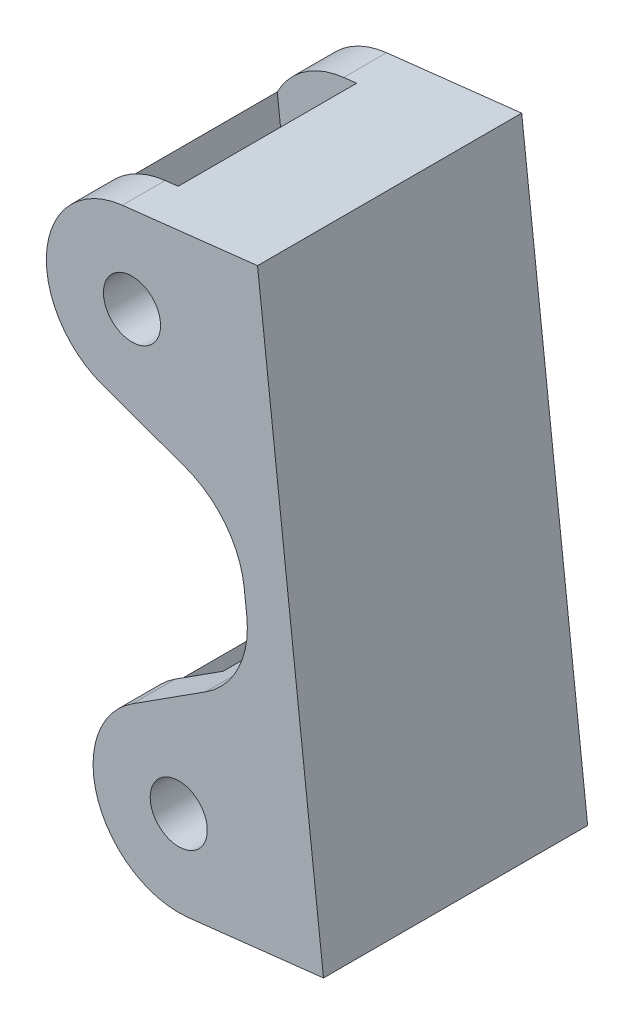
ISO-10303-21;
HEADER;
FILE_DESCRIPTION(('STEP AP214'),'2;1');
FILE_NAME('part.step','',(''),(''),'','','');
FILE_SCHEMA(('AUTOMOTIVE_DESIGN { 1 0 10303 214 1 1 1 1 }'));
ENDSEC;
DATA;
#1=APPLICATION_CONTEXT('core data for automotive mechanical design processes');
#2=APPLICATION_PROTOCOL_DEFINITION('international standard','automotive_design',2000,#1);
#3=PRODUCT_CONTEXT('',#1,'mechanical');
#4=PRODUCT('Part','Part','',(#3));
#5=PRODUCT_RELATED_PRODUCT_CATEGORY('part','',(#4));
#6=PRODUCT_DEFINITION_FORMATION('','',#4);
#7=PRODUCT_DEFINITION_CONTEXT('part definition',#1,'design');
#8=PRODUCT_DEFINITION('design','',#6,#7);
#9=PRODUCT_DEFINITION_SHAPE('','',#8);
#10=(LENGTH_UNIT() NAMED_UNIT(*) SI_UNIT(.MILLI.,.METRE.));
#11=(NAMED_UNIT(*) PLANE_ANGLE_UNIT() SI_UNIT($,.RADIAN.));
#12=(NAMED_UNIT(*) SI_UNIT($,.STERADIAN.) SOLID_ANGLE_UNIT());
#13=UNCERTAINTY_MEASURE_WITH_UNIT(LENGTH_MEASURE(1.E-05),#10,'distance_accuracy_value','');
#14=(GEOMETRIC_REPRESENTATION_CONTEXT(3) GLOBAL_UNCERTAINTY_ASSIGNED_CONTEXT((#13)) GLOBAL_UNIT_ASSIGNED_CONTEXT((#10,
#11,#12)) REPRESENTATION_CONTEXT('',''));
#15=CARTESIAN_POINT('',(0.,0.,0.));
#16=DIRECTION('',(0.,0.,1.));
#17=DIRECTION('',(1.,0.,0.));
#18=AXIS2_PLACEMENT_3D('',#15,#16,#17);
#19=CARTESIAN_POINT('',(100.855743208595,-311.690272512316,-18.5000000000001));
#20=DIRECTION('',(0.338368031046587,0.941013855140112,0.));
#21=DIRECTION('',(-0.941013855140112,0.338368031046587,0.));
#22=AXIS2_PLACEMENT_3D('',#19,#20,#21);
#23=PLANE('',#22);
#24=DIRECTION('',(-0.941013855140112,0.338368031046587,0.));
#25=VECTOR('',#24,1.);
#26=CARTESIAN_POINT('',(100.855743208595,-311.690272512316,12.4999999999999));
#27=LINE('',#26,#25);
#28=CARTESIAN_POINT('',(108.329287671099,-314.377595882639,12.4999999999999));
#29=VERTEX_POINT('',#28);
#30=CARTESIAN_POINT('',(100.855743208595,-311.690272512316,12.4999999999999));
#31=VERTEX_POINT('',#30);
#32=EDGE_CURVE('E250',#29,#31,#27,.T.);
#33=ORIENTED_EDGE('',*,*,#32,.F.);
#34=DIRECTION('',(0.,0.,-1.));
#35=VECTOR('',#34,1.);
#36=CARTESIAN_POINT('',(108.329287671099,-314.377595882639,-18.5000000000001));
#37=LINE('',#36,#35);
#38=CARTESIAN_POINT('',(108.329287671099,-314.377595882639,-12.5000000000001));
#39=VERTEX_POINT('',#38);
#40=EDGE_CURVE('E266',#29,#39,#37,.T.);
#41=ORIENTED_EDGE('',*,*,#40,.T.);
#42=DIRECTION('',(-0.941013855140112,0.338368031046587,0.));
#43=VECTOR('',#42,1.);
#44=CARTESIAN_POINT('',(100.855743208595,-311.690272512316,-12.5000000000001));
#45=LINE('',#44,#43);
#46=CARTESIAN_POINT('',(100.855743208595,-311.690272512316,-12.5000000000001));
#47=VERTEX_POINT('',#46);
#48=EDGE_CURVE('E390',#39,#47,#45,.T.);
#49=ORIENTED_EDGE('',*,*,#48,.T.);
#50=DIRECTION('',(0.,0.,1.));
#51=VECTOR('',#50,1.);
#52=CARTESIAN_POINT('',(100.855743208595,-311.690272512316,-18.5000000000001));
#53=LINE('',#52,#51);
#54=CARTESIAN_POINT('',(100.855743208595,-311.690272512316,-18.5000000000001));
#55=VERTEX_POINT('',#54);
#56=EDGE_CURVE('E358',#55,#47,#53,.T.);
#57=ORIENTED_EDGE('',*,*,#56,.F.);
#58=DIRECTION('',(-0.941013855140112,0.338368031046587,0.));
#59=VECTOR('',#58,1.);
#60=CARTESIAN_POINT('',(100.855743208595,-311.690272512316,-18.5000000000001));
#61=LINE('',#60,#59);
#62=CARTESIAN_POINT('',(112.302897911786,-315.806419343573,-18.5000000000001));
#63=VERTEX_POINT('',#62);
#64=EDGE_CURVE('E291',#63,#55,#61,.T.);
#65=ORIENTED_EDGE('',*,*,#64,.F.);
#66=DIRECTION('',(0.,0.,1.));
#67=VECTOR('',#66,1.);
#68=CARTESIAN_POINT('',(112.302897911786,-315.806419343573,-18.5000000000001));
#69=LINE('',#68,#67);
#70=CARTESIAN_POINT('',(112.302897911786,-315.806419343573,18.4999999999999));
#71=VERTEX_POINT('',#70);
#72=EDGE_CURVE('E361',#63,#71,#69,.T.);
#73=ORIENTED_EDGE('',*,*,#72,.T.);
#74=DIRECTION('',(-0.941013855140112,0.338368031046587,0.));
#75=VECTOR('',#74,1.);
#76=CARTESIAN_POINT('',(100.855743208595,-311.690272512316,18.4999999999999));
#77=LINE('',#76,#75);
#78=CARTESIAN_POINT('',(100.855743208595,-311.690272512316,18.4999999999999));
#79=VERTEX_POINT('',#78);
#80=EDGE_CURVE('E313',#71,#79,#77,.T.);
#81=ORIENTED_EDGE('',*,*,#80,.T.);
#82=EDGE_CURVE('E357',#31,#79,#53,.T.);
#83=ORIENTED_EDGE('',*,*,#82,.F.);
#84=EDGE_LOOP('',(#33,#41,#49,#57,#65,#73,#81,#83));
#85=FACE_BOUND('',#84,.T.);
#86=ADVANCED_FACE('F37',(#85),#23,.F.);
#87=CARTESIAN_POINT('',(104.916159581154,-300.398106250634,-18.5000000000001));
#88=DIRECTION('',(0.,0.,1.));
#89=DIRECTION('',(1.,0.,0.));
#90=AXIS2_PLACEMENT_3D('',#87,#88,#89);
#91=CYLINDRICAL_SURFACE('',#90,12.);
#92=CARTESIAN_POINT('',(104.916159581154,-300.398106250634,12.4999999999999));
#93=DIRECTION('',(0.,0.,-1.));
#94=DIRECTION('',(-1.,0.,0.));
#95=AXIS2_PLACEMENT_3D('',#92,#93,#94);
#96=CIRCLE('',#95,12.);
#97=CARTESIAN_POINT('',(94.2617769576401,-294.876862648712,12.4999999999999));
#98=VERTEX_POINT('',#97);
#99=CARTESIAN_POINT('',(103.569218525989,-288.473939621728,12.4999999999999));
#100=VERTEX_POINT('',#99);
#101=EDGE_CURVE('E247',#98,#100,#96,.T.);
#102=ORIENTED_EDGE('',*,*,#101,.F.);
#103=DIRECTION('',(0.,0.,1.));
#104=VECTOR('',#103,1.);
#105=CARTESIAN_POINT('',(94.2617769576401,-294.876862648712,-18.5000000000001));
#106=LINE('',#105,#104);
#107=CARTESIAN_POINT('',(94.2617769576401,-294.876862648712,-12.5000000000001));
#108=VERTEX_POINT('',#107);
#109=EDGE_CURVE('E269',#98,#108,#106,.F.);
#110=ORIENTED_EDGE('',*,*,#109,.T.);
#111=CARTESIAN_POINT('',(104.916159581154,-300.398106250634,-12.5000000000001));
#112=DIRECTION('',(0.,0.,-1.));
#113=DIRECTION('',(-1.,0.,0.));
#114=AXIS2_PLACEMENT_3D('',#111,#112,#113);
#115=CIRCLE('',#114,12.);
#116=CARTESIAN_POINT('',(103.569218525989,-288.473939621728,-12.5000000000001));
#117=VERTEX_POINT('',#116);
#118=EDGE_CURVE('E386',#108,#117,#115,.T.);
#119=ORIENTED_EDGE('',*,*,#118,.T.);
#120=DIRECTION('',(0.,0.,1.));
#121=VECTOR('',#120,1.);
#122=CARTESIAN_POINT('',(103.569218525989,-288.473939621728,-18.5000000000001));
#123=LINE('',#122,#121);
#124=CARTESIAN_POINT('',(103.569218525989,-288.473939621728,-18.5000000000001));
#125=VERTEX_POINT('',#124);
#126=EDGE_CURVE('E354',#125,#117,#123,.T.);
#127=ORIENTED_EDGE('',*,*,#126,.F.);
#128=CARTESIAN_POINT('',(104.916159581154,-300.398106250634,-18.5000000000001));
#129=DIRECTION('',(0.,0.,-1.));
#130=DIRECTION('',(-1.,0.,0.));
#131=AXIS2_PLACEMENT_3D('',#128,#129,#130);
#132=CIRCLE('',#131,12.);
#133=EDGE_CURVE('E294',#55,#125,#132,.T.);
#134=ORIENTED_EDGE('',*,*,#133,.F.);
#135=ORIENTED_EDGE('',*,*,#56,.T.);
#136=CARTESIAN_POINT('',(95.7618774470101,-308.156915347944,-12.5000000000001));
#137=VERTEX_POINT('',#136);
#138=EDGE_CURVE('E389',#47,#137,#115,.T.);
#139=ORIENTED_EDGE('',*,*,#138,.T.);
#140=DIRECTION('',(0.,0.,1.));
#141=VECTOR('',#140,1.);
#142=CARTESIAN_POINT('',(95.7618774470101,-308.156915347944,-18.5000000000001));
#143=LINE('',#142,#141);
#144=CARTESIAN_POINT('',(95.7618774470101,-308.156915347944,12.4999999999999));
#145=VERTEX_POINT('',#144);
#146=EDGE_CURVE('E272',#137,#145,#143,.T.);
#147=ORIENTED_EDGE('',*,*,#146,.T.);
#148=EDGE_CURVE('E249',#31,#145,#96,.T.);
#149=ORIENTED_EDGE('',*,*,#148,.F.);
#150=ORIENTED_EDGE('',*,*,#82,.T.);
#151=CARTESIAN_POINT('',(104.916159581154,-300.398106250634,18.4999999999999));
#152=DIRECTION('',(0.,0.,-1.));
#153=DIRECTION('',(-1.,0.,0.));
#154=AXIS2_PLACEMENT_3D('',#151,#152,#153);
#155=CIRCLE('',#154,12.);
#156=CARTESIAN_POINT('',(103.569218525989,-288.473939621728,18.4999999999999));
#157=VERTEX_POINT('',#156);
#158=EDGE_CURVE('E316',#79,#157,#155,.T.);
#159=ORIENTED_EDGE('',*,*,#158,.T.);
#160=EDGE_CURVE('E353',#100,#157,#123,.T.);
#161=ORIENTED_EDGE('',*,*,#160,.F.);
#162=EDGE_LOOP('',(#102,#110,#119,#127,#134,#135,#139,#147,#149,#150,#159,#161));
#163=FACE_BOUND('',#162,.T.);
#164=ADVANCED_FACE('F483',(#163),#91,.T.);
#165=CARTESIAN_POINT('',(122.497845378006,-286.335782262951,-18.5000000000001));
#166=DIRECTION('',(0.112245087930424,-0.993680552408817,0.));
#167=DIRECTION('',(0.993680552408817,0.112245087930424,0.));
#168=AXIS2_PLACEMENT_3D('',#165,#166,#167);
#169=PLANE('',#168);
#170=DIRECTION('',(0.993680552408817,0.112245087930424,0.));
#171=VECTOR('',#170,1.);
#172=CARTESIAN_POINT('',(122.497845378006,-286.335782262951,12.4999999999999));
#173=LINE('',#172,#171);
#174=CARTESIAN_POINT('',(105.380131738241,-288.269380810297,12.4999999999999));
#175=VERTEX_POINT('',#174);
#176=EDGE_CURVE('E245',#100,#175,#173,.T.);
#177=ORIENTED_EDGE('',*,*,#176,.F.);
#178=ORIENTED_EDGE('',*,*,#160,.T.);
#179=DIRECTION('',(0.993680552408817,0.112245087930424,0.));
#180=VECTOR('',#179,1.);
#181=CARTESIAN_POINT('',(122.497845378006,-286.335782262951,18.4999999999999));
#182=LINE('',#181,#180);
#183=CARTESIAN_POINT('',(122.497845378006,-286.335782262951,18.4999999999999));
#184=VERTEX_POINT('',#183);
#185=EDGE_CURVE('E319',#157,#184,#182,.T.);
#186=ORIENTED_EDGE('',*,*,#185,.T.);
#187=DIRECTION('',(0.,0.,1.));
#188=VECTOR('',#187,1.);
#189=CARTESIAN_POINT('',(122.497845378006,-286.335782262951,-18.5000000000001));
#190=LINE('',#189,#188);
#191=CARTESIAN_POINT('',(122.497845378006,-286.335782262951,-18.5000000000001));
#192=VERTEX_POINT('',#191);
#193=EDGE_CURVE('E350',#192,#184,#190,.T.);
#194=ORIENTED_EDGE('',*,*,#193,.F.);
#195=DIRECTION('',(0.993680552408817,0.112245087930424,0.));
#196=VECTOR('',#195,1.);
#197=CARTESIAN_POINT('',(122.497845378006,-286.335782262951,-18.5000000000001));
#198=LINE('',#197,#196);
#199=EDGE_CURVE('E296',#125,#192,#198,.T.);
#200=ORIENTED_EDGE('',*,*,#199,.F.);
#201=ORIENTED_EDGE('',*,*,#126,.T.);
#202=DIRECTION('',(0.993680552408817,0.112245087930424,0.));
#203=VECTOR('',#202,1.);
#204=CARTESIAN_POINT('',(122.497845378006,-286.335782262951,-12.5000000000001));
#205=LINE('',#204,#203);
#206=CARTESIAN_POINT('',(105.380131738241,-288.269380810297,-12.5000000000001));
#207=VERTEX_POINT('',#206);
#208=EDGE_CURVE('E379',#117,#207,#205,.T.);
#209=ORIENTED_EDGE('',*,*,#208,.T.);
#210=DIRECTION('',(0.,0.,1.));
#211=VECTOR('',#210,1.);
#212=CARTESIAN_POINT('',(105.380131738241,-288.269380810297,-18.5000000000001));
#213=LINE('',#212,#211);
#214=EDGE_CURVE('E263',#207,#175,#213,.T.);
#215=ORIENTED_EDGE('',*,*,#214,.T.);
#216=EDGE_LOOP('',(#177,#178,#186,#194,#200,#201,#209,#215));
#217=FACE_BOUND('',#216,.T.);
#218=ADVANCED_FACE('F486',(#217),#169,.F.);
#219=CARTESIAN_POINT('',(112.807269339854,-370.26518374454,-18.5000000000001));
#220=DIRECTION('',(-0.112245087930424,0.993680552408817,0.));
#221=DIRECTION('',(-0.993680552408817,-0.112245087930424,0.));
#222=AXIS2_PLACEMENT_3D('',#219,#220,#221);
#223=PLANE('',#222);
#224=DIRECTION('',(-0.993680552408817,-0.112245087930424,0.));
#225=VECTOR('',#224,1.);
#226=CARTESIAN_POINT('',(112.807269339854,-370.26518374454,12.4999999999999));
#227=LINE('',#226,#225);
#228=CARTESIAN_POINT('',(114.619170223477,-370.060513366811,12.4999999999999));
#229=VERTEX_POINT('',#228);
#230=CARTESIAN_POINT('',(112.807269339854,-370.26518374454,12.4999999999999));
#231=VERTEX_POINT('',#230);
#232=EDGE_CURVE('E239',#229,#231,#227,.T.);
#233=ORIENTED_EDGE('',*,*,#232,.F.);
#234=DIRECTION('',(0.,0.,-1.));
#235=VECTOR('',#234,1.);
#236=CARTESIAN_POINT('',(114.619170223477,-370.060513366811,-18.5000000000001));
#237=LINE('',#236,#235);
#238=CARTESIAN_POINT('',(114.619170223477,-370.060513366811,-12.5000000000001));
#239=VERTEX_POINT('',#238);
#240=EDGE_CURVE('E260',#229,#239,#237,.T.);
#241=ORIENTED_EDGE('',*,*,#240,.T.);
#242=DIRECTION('',(-0.993680552408817,-0.112245087930424,0.));
#243=VECTOR('',#242,1.);
#244=CARTESIAN_POINT('',(112.807269339854,-370.26518374454,-12.5000000000001));
#245=LINE('',#244,#243);
#246=CARTESIAN_POINT('',(112.807269339854,-370.26518374454,-12.5000000000001));
#247=VERTEX_POINT('',#246);
#248=EDGE_CURVE('E378',#239,#247,#245,.T.);
#249=ORIENTED_EDGE('',*,*,#248,.T.);
#250=DIRECTION('',(0.,0.,1.));
#251=VECTOR('',#250,1.);
#252=CARTESIAN_POINT('',(112.807269339854,-370.26518374454,-18.5000000000001));
#253=LINE('',#252,#251);
#254=CARTESIAN_POINT('',(112.807269339854,-370.26518374454,-18.5000000000001));
#255=VERTEX_POINT('',#254);
#256=EDGE_CURVE('E344',#255,#247,#253,.T.);
#257=ORIENTED_EDGE('',*,*,#256,.F.);
#258=DIRECTION('',(-0.993680552408817,-0.112245087930424,0.));
#259=VECTOR('',#258,1.);
#260=CARTESIAN_POINT('',(112.807269339854,-370.26518374454,-18.5000000000001));
#261=LINE('',#260,#259);
#262=CARTESIAN_POINT('',(131.736883863242,-368.126914819466,-18.5000000000001));
#263=VERTEX_POINT('',#262);
#264=EDGE_CURVE('E300',#263,#255,#261,.T.);
#265=ORIENTED_EDGE('',*,*,#264,.F.);
#266=DIRECTION('',(0.,0.,1.));
#267=VECTOR('',#266,1.);
#268=CARTESIAN_POINT('',(131.736883863242,-368.126914819466,-18.5000000000001));
#269=LINE('',#268,#267);
#270=CARTESIAN_POINT('',(131.736883863242,-368.126914819466,18.4999999999999));
#271=VERTEX_POINT('',#270);
#272=EDGE_CURVE('E347',#263,#271,#269,.T.);
#273=ORIENTED_EDGE('',*,*,#272,.T.);
#274=DIRECTION('',(-0.993680552408817,-0.112245087930424,0.));
#275=VECTOR('',#274,1.);
#276=CARTESIAN_POINT('',(112.807269339854,-370.26518374454,18.4999999999999));
#277=LINE('',#276,#275);
#278=CARTESIAN_POINT('',(112.807269339854,-370.26518374454,18.4999999999999));
#279=VERTEX_POINT('',#278);
#280=EDGE_CURVE('E323',#271,#279,#277,.T.);
#281=ORIENTED_EDGE('',*,*,#280,.T.);
#282=EDGE_CURVE('E343',#231,#279,#253,.T.);
#283=ORIENTED_EDGE('',*,*,#282,.F.);
#284=EDGE_LOOP('',(#233,#241,#249,#257,#265,#273,#281,#283));
#285=FACE_BOUND('',#284,.T.);
#286=ADVANCED_FACE('F435',(#285),#223,.F.);
#287=CARTESIAN_POINT('',(111.460328284689,-358.341017115634,-18.5000000000001));
#288=DIRECTION('',(0.,0.,1.));
#289=DIRECTION('',(1.,0.,0.));
#290=AXIS2_PLACEMENT_3D('',#287,#288,#289);
#291=CYLINDRICAL_SURFACE('',#290,12.);
#292=CARTESIAN_POINT('',(111.460328284689,-358.341017115634,12.4999999999999));
#293=DIRECTION('',(0.,0.,-1.));
#294=DIRECTION('',(-1.,0.,0.));
#295=AXIS2_PLACEMENT_3D('',#292,#293,#294);
#296=CIRCLE('',#295,12.);
#297=CARTESIAN_POINT('',(100.806766945848,-352.818188963359,12.4999999999999));
#298=VERTEX_POINT('',#297);
#299=CARTESIAN_POINT('',(104.984197969497,-348.238555230497,12.4999999999999));
#300=VERTEX_POINT('',#299);
#301=EDGE_CURVE('E231',#298,#300,#296,.T.);
#302=ORIENTED_EDGE('',*,*,#301,.F.);
#303=DIRECTION('',(0.,0.,1.));
#304=VECTOR('',#303,1.);
#305=CARTESIAN_POINT('',(100.806766945848,-352.818188963359,-18.5000000000001));
#306=LINE('',#305,#304);
#307=CARTESIAN_POINT('',(100.806766945848,-352.818188963359,-12.5000000000001));
#308=VERTEX_POINT('',#307);
#309=EDGE_CURVE('E11',#298,#308,#306,.F.);
#310=ORIENTED_EDGE('',*,*,#309,.T.);
#311=CARTESIAN_POINT('',(111.460328284689,-358.341017115634,-12.5000000000001));
#312=DIRECTION('',(0.,0.,-1.));
#313=DIRECTION('',(-1.,0.,0.));
#314=AXIS2_PLACEMENT_3D('',#311,#312,#313);
#315=CIRCLE('',#314,12.);
#316=CARTESIAN_POINT('',(104.984197969497,-348.238555230497,-12.5000000000001));
#317=VERTEX_POINT('',#316);
#318=EDGE_CURVE('E208',#308,#317,#315,.T.);
#319=ORIENTED_EDGE('',*,*,#318,.T.);
#320=DIRECTION('',(0.,0.,1.));
#321=VECTOR('',#320,1.);
#322=CARTESIAN_POINT('',(104.984197969497,-348.238555230497,-18.5000000000001));
#323=LINE('',#322,#321);
#324=CARTESIAN_POINT('',(104.984197969497,-348.238555230497,-18.5000000000001));
#325=VERTEX_POINT('',#324);
#326=EDGE_CURVE('E341',#325,#317,#323,.T.);
#327=ORIENTED_EDGE('',*,*,#326,.F.);
#328=CARTESIAN_POINT('',(111.460328284689,-358.341017115634,-18.5000000000001));
#329=DIRECTION('',(0.,0.,-1.));
#330=DIRECTION('',(-1.,0.,0.));
#331=AXIS2_PLACEMENT_3D('',#328,#329,#330);
#332=CIRCLE('',#331,12.);
#333=EDGE_CURVE('E302',#255,#325,#332,.T.);
#334=ORIENTED_EDGE('',*,*,#333,.F.);
#335=ORIENTED_EDGE('',*,*,#256,.T.);
#336=CARTESIAN_POINT('',(102.307200208612,-366.101187630703,-12.5000000000001));
#337=VERTEX_POINT('',#336);
#338=EDGE_CURVE('E218',#247,#337,#315,.T.);
#339=ORIENTED_EDGE('',*,*,#338,.T.);
#340=DIRECTION('',(0.,0.,1.));
#341=VECTOR('',#340,1.);
#342=CARTESIAN_POINT('',(102.307200208612,-366.101187630703,-18.5000000000001));
#343=LINE('',#342,#341);
#344=CARTESIAN_POINT('',(102.307200208612,-366.101187630703,12.4999999999999));
#345=VERTEX_POINT('',#344);
#346=EDGE_CURVE('E45',#337,#345,#343,.T.);
#347=ORIENTED_EDGE('',*,*,#346,.T.);
#348=EDGE_CURVE('E236',#231,#345,#296,.T.);
#349=ORIENTED_EDGE('',*,*,#348,.F.);
#350=ORIENTED_EDGE('',*,*,#282,.T.);
#351=CARTESIAN_POINT('',(111.460328284689,-358.341017115634,18.4999999999999));
#352=DIRECTION('',(0.,0.,-1.));
#353=DIRECTION('',(-1.,0.,0.));
#354=AXIS2_PLACEMENT_3D('',#351,#352,#353);
#355=CIRCLE('',#354,12.);
#356=CARTESIAN_POINT('',(104.984197969497,-348.238555230497,18.4999999999999));
#357=VERTEX_POINT('',#356);
#358=EDGE_CURVE('E326',#279,#357,#355,.T.);
#359=ORIENTED_EDGE('',*,*,#358,.T.);
#360=EDGE_CURVE('E233',#300,#357,#323,.T.);
#361=ORIENTED_EDGE('',*,*,#360,.F.);
#362=EDGE_LOOP('',(#302,#310,#319,#327,#334,#335,#339,#347,#349,#350,#359,#361));
#363=FACE_BOUND('',#362,.T.);
#364=ADVANCED_FACE('F229',(#363),#291,.T.);
#365=CARTESIAN_POINT('',(104.984197969497,-348.238555230497,-18.5000000000001));
#366=DIRECTION('',(0.539677526265937,-0.841871823761479,0.));
#367=DIRECTION('',(0.841871823761479,0.539677526265937,0.));
#368=AXIS2_PLACEMENT_3D('',#365,#366,#367);
#369=PLANE('',#368);
#370=DIRECTION('',(0.841871823761479,0.539677526265937,0.));
#371=VECTOR('',#370,1.);
#372=CARTESIAN_POINT('',(104.984197969497,-348.238555230497,12.4999999999999));
#373=LINE('',#372,#371);
#374=CARTESIAN_POINT('',(111.670051091077,-343.952624080657,12.4999999999999));
#375=VERTEX_POINT('',#374);
#376=EDGE_CURVE('E237',#300,#375,#373,.T.);
#377=ORIENTED_EDGE('',*,*,#376,.F.);
#378=ORIENTED_EDGE('',*,*,#360,.T.);
#379=DIRECTION('',(0.841871823761479,0.539677526265937,0.));
#380=VECTOR('',#379,1.);
#381=CARTESIAN_POINT('',(104.984197969497,-348.238555230497,18.4999999999999));
#382=LINE('',#381,#380);
#383=CARTESIAN_POINT('',(115.223866434292,-341.674469355555,18.4999999999999));
#384=VERTEX_POINT('',#383);
#385=EDGE_CURVE('E328',#357,#384,#382,.T.);
#386=ORIENTED_EDGE('',*,*,#385,.T.);
#387=DIRECTION('',(0.,0.,1.));
#388=VECTOR('',#387,1.);
#389=CARTESIAN_POINT('',(115.223866434292,-341.674469355555,-18.5000000000001));
#390=LINE('',#389,#388);
#391=CARTESIAN_POINT('',(115.223866434292,-341.674469355555,-18.5000000000001));
#392=VERTEX_POINT('',#391);
#393=EDGE_CURVE('E338',#392,#384,#390,.T.);
#394=ORIENTED_EDGE('',*,*,#393,.F.);
#395=DIRECTION('',(0.841871823761479,0.539677526265937,0.));
#396=VECTOR('',#395,1.);
#397=CARTESIAN_POINT('',(104.984197969497,-348.238555230497,-18.5000000000001));
#398=LINE('',#397,#396);
#399=EDGE_CURVE('E304',#325,#392,#398,.T.);
#400=ORIENTED_EDGE('',*,*,#399,.F.);
#401=ORIENTED_EDGE('',*,*,#326,.T.);
#402=DIRECTION('',(0.841871823761479,0.539677526265937,0.));
#403=VECTOR('',#402,1.);
#404=CARTESIAN_POINT('',(104.984197969497,-348.238555230497,-12.5000000000001));
#405=LINE('',#404,#403);
#406=CARTESIAN_POINT('',(111.670051091077,-343.952624080657,-12.5000000000001));
#407=VERTEX_POINT('',#406);
#408=EDGE_CURVE('E214',#317,#407,#405,.T.);
#409=ORIENTED_EDGE('',*,*,#408,.T.);
#410=DIRECTION('',(0.,0.,1.));
#411=VECTOR('',#410,1.);
#412=CARTESIAN_POINT('',(111.670051091077,-343.952624080657,-18.5000000000001));
#413=LINE('',#412,#411);
#414=EDGE_CURVE('E257',#407,#375,#413,.T.);
#415=ORIENTED_EDGE('',*,*,#414,.T.);
#416=EDGE_LOOP('',(#377,#378,#386,#394,#400,#401,#409,#415));
#417=FACE_BOUND('',#416,.T.);
#418=ADVANCED_FACE('F423',(#417),#369,.F.);
#419=CARTESIAN_POINT('',(104.916159581154,-300.398106250634,-18.5000000000001));
#420=DIRECTION('',(0.,0.,1.));
#421=DIRECTION('',(1.,0.,0.));
#422=AXIS2_PLACEMENT_3D('',#419,#420,#421);
#423=CYLINDRICAL_SURFACE('',#422,3.99999999999998);
#424=CARTESIAN_POINT('',(104.916159581154,-300.398106250634,-18.5000000000001));
#425=DIRECTION('',(0.,0.,-1.));
#426=DIRECTION('',(-1.,0.,0.));
#427=AXIS2_PLACEMENT_3D('',#424,#425,#426);
#428=CIRCLE('',#427,3.99999999999998);
#429=CARTESIAN_POINT('',(100.916159581154,-300.398106250634,-18.5000000000001));
#430=VERTEX_POINT('',#429);
#431=EDGE_CURVE('E282',#430,#430,#428,.T.);
#432=ORIENTED_EDGE('',*,*,#431,.T.);
#433=EDGE_LOOP('',(#432));
#434=FACE_BOUND('',#433,.T.);
#435=CARTESIAN_POINT('',(104.916159581154,-300.398106250634,18.4999999999999));
#436=DIRECTION('',(0.,0.,-1.));
#437=DIRECTION('',(-1.,0.,0.));
#438=AXIS2_PLACEMENT_3D('',#435,#436,#437);
#439=CIRCLE('',#438,3.99999999999998);
#440=CARTESIAN_POINT('',(100.916159581154,-300.398106250634,18.4999999999999));
#441=VERTEX_POINT('',#440);
#442=EDGE_CURVE('E279',#441,#441,#439,.T.);
#443=ORIENTED_EDGE('',*,*,#442,.F.);
#444=EDGE_LOOP('',(#443));
#445=FACE_BOUND('',#444,.T.);
#446=DIRECTION('',(0.,0.,1.));
#447=VECTOR('',#446,1.);
#448=CARTESIAN_POINT('',(107.126746471421,-303.731768741136,-18.5000000000001));
#449=LINE('',#448,#447);
#450=CARTESIAN_POINT('',(107.126746471421,-303.731768741136,12.4999999999999));
#451=VERTEX_POINT('',#450);
#452=CARTESIAN_POINT('',(107.126746471421,-303.731768741136,-12.5000000000001));
#453=VERTEX_POINT('',#452);
#454=EDGE_CURVE('E252',#451,#453,#449,.F.);
#455=ORIENTED_EDGE('',*,*,#454,.F.);
#456=CARTESIAN_POINT('',(104.916159581154,-300.398106250634,12.4999999999999));
#457=DIRECTION('',(0.,0.,-1.));
#458=DIRECTION('',(-1.,0.,0.));
#459=AXIS2_PLACEMENT_3D('',#456,#457,#458);
#460=CIRCLE('',#459,3.99999999999998);
#461=CARTESIAN_POINT('',(106.327399115392,-296.655326137269,12.4999999999999));
#462=VERTEX_POINT('',#461);
#463=EDGE_CURVE('E240',#451,#462,#460,.T.);
#464=ORIENTED_EDGE('',*,*,#463,.T.);
#465=DIRECTION('',(0.,0.,1.));
#466=VECTOR('',#465,1.);
#467=CARTESIAN_POINT('',(106.327399115392,-296.655326137269,-18.5000000000001));
#468=LINE('',#467,#466);
#469=CARTESIAN_POINT('',(106.327399115392,-296.655326137269,-12.5000000000001));
#470=VERTEX_POINT('',#469);
#471=EDGE_CURVE('E255',#470,#462,#468,.T.);
#472=ORIENTED_EDGE('',*,*,#471,.F.);
#473=CARTESIAN_POINT('',(104.916159581154,-300.398106250634,-12.5000000000001));
#474=DIRECTION('',(0.,0.,-1.));
#475=DIRECTION('',(-1.,0.,0.));
#476=AXIS2_PLACEMENT_3D('',#473,#474,#475);
#477=CIRCLE('',#476,3.99999999999998);
#478=EDGE_CURVE('E412',#453,#470,#477,.T.);
#479=ORIENTED_EDGE('',*,*,#478,.F.);
#480=EDGE_LOOP('',(#455,#464,#472,#479));
#481=FACE_BOUND('',#480,.T.);
#482=ADVANCED_FACE('F396',(#434,#445,#481),#423,.F.);
#483=CARTESIAN_POINT('',(111.460328284689,-358.341017115634,-18.5000000000001));
#484=DIRECTION('',(0.,0.,1.));
#485=DIRECTION('',(1.,0.,0.));
#486=AXIS2_PLACEMENT_3D('',#483,#484,#485);
#487=CYLINDRICAL_SURFACE('',#486,3.99999999999999);
#488=CARTESIAN_POINT('',(111.460328284689,-358.341017115634,-18.5000000000001));
#489=DIRECTION('',(0.,0.,-1.));
#490=DIRECTION('',(-1.,0.,0.));
#491=AXIS2_PLACEMENT_3D('',#488,#489,#490);
#492=CIRCLE('',#491,3.99999999999999);
#493=CARTESIAN_POINT('',(107.460328284689,-358.341017115634,-18.5000000000001));
#494=VERTEX_POINT('',#493);
#495=EDGE_CURVE('E276',#494,#494,#492,.T.);
#496=ORIENTED_EDGE('',*,*,#495,.T.);
#497=EDGE_LOOP('',(#496));
#498=FACE_BOUND('',#497,.T.);
#499=CARTESIAN_POINT('',(111.460328284689,-358.341017115634,18.4999999999999));
#500=DIRECTION('',(0.,0.,-1.));
#501=DIRECTION('',(-1.,0.,0.));
#502=AXIS2_PLACEMENT_3D('',#499,#500,#501);
#503=CIRCLE('',#502,3.99999999999999);
#504=CARTESIAN_POINT('',(107.460328284689,-358.341017115634,18.4999999999999));
#505=VERTEX_POINT('',#504);
#506=EDGE_CURVE('E275',#505,#505,#503,.T.);
#507=ORIENTED_EDGE('',*,*,#506,.F.);
#508=EDGE_LOOP('',(#507));
#509=FACE_BOUND('',#508,.T.);
#510=DIRECTION('',(0.,0.,1.));
#511=VECTOR('',#510,1.);
#512=CARTESIAN_POINT('',(113.671845725416,-361.674062361255,-18.5000000000001));
#513=LINE('',#512,#511);
#514=CARTESIAN_POINT('',(113.671845725416,-361.674062361255,12.4999999999999));
#515=VERTEX_POINT('',#514);
#516=CARTESIAN_POINT('',(113.671845725416,-361.674062361255,-12.5000000000001));
#517=VERTEX_POINT('',#516);
#518=EDGE_CURVE('E366',#515,#517,#513,.F.);
#519=ORIENTED_EDGE('',*,*,#518,.F.);
#520=CARTESIAN_POINT('',(111.460328284689,-358.341017115634,12.4999999999999));
#521=DIRECTION('',(0.,0.,-1.));
#522=DIRECTION('',(-1.,0.,0.));
#523=AXIS2_PLACEMENT_3D('',#520,#521,#522);
#524=CIRCLE('',#523,3.99999999999999);
#525=CARTESIAN_POINT('',(112.872612611207,-354.598631114555,12.4999999999999));
#526=VERTEX_POINT('',#525);
#527=EDGE_CURVE('E371',#515,#526,#524,.T.);
#528=ORIENTED_EDGE('',*,*,#527,.T.);
#529=DIRECTION('',(0.,0.,1.));
#530=VECTOR('',#529,1.);
#531=CARTESIAN_POINT('',(112.872612611207,-354.598631114555,-18.5000000000001));
#532=LINE('',#531,#530);
#533=CARTESIAN_POINT('',(112.872612611207,-354.598631114555,-12.5000000000001));
#534=VERTEX_POINT('',#533);
#535=EDGE_CURVE('E369',#534,#526,#532,.T.);
#536=ORIENTED_EDGE('',*,*,#535,.F.);
#537=CARTESIAN_POINT('',(111.460328284689,-358.341017115634,-12.5000000000001));
#538=DIRECTION('',(0.,0.,-1.));
#539=DIRECTION('',(-1.,0.,0.));
#540=AXIS2_PLACEMENT_3D('',#537,#538,#539);
#541=CIRCLE('',#540,3.99999999999999);
#542=EDGE_CURVE('E364',#517,#534,#541,.T.);
#543=ORIENTED_EDGE('',*,*,#542,.F.);
#544=EDGE_LOOP('',(#519,#528,#536,#543));
#545=FACE_BOUND('',#544,.T.);
#546=ADVANCED_FACE('F443',(#498,#509,#545),#487,.F.);
#547=CARTESIAN_POINT('',(108.005623917494,-327.757295303852,-18.5000000000001));
#548=DIRECTION('',(0.,0.,-1.));
#549=DIRECTION('',(-1.,0.,0.));
#550=AXIS2_PLACEMENT_3D('',#547,#548,#549);
#551=PLANE('',#550);
#552=ORIENTED_EDGE('',*,*,#431,.F.);
#553=EDGE_LOOP('',(#552));
#554=FACE_BOUND('',#553,.T.);
#555=CARTESIAN_POINT('',(108.005623917494,-327.757295303852,-18.5000000000001));
#556=DIRECTION('',(0.,0.,1.));
#557=DIRECTION('',(-1.,0.,0.));
#558=AXIS2_PLACEMENT_3D('',#555,#556,#557);
#559=CIRCLE('',#558,12.7);
#560=CARTESIAN_POINT('',(120.625366933086,-326.331782687136,-18.5000000000001));
#561=VERTEX_POINT('',#560);
#562=EDGE_CURVE('E288',#561,#63,#559,.T.);
#563=ORIENTED_EDGE('',*,*,#562,.T.);
#564=ORIENTED_EDGE('',*,*,#64,.T.);
#565=ORIENTED_EDGE('',*,*,#133,.T.);
#566=ORIENTED_EDGE('',*,*,#199,.T.);
#567=DIRECTION('',(0.112245087930422,-0.993680552408817,0.));
#568=VECTOR('',#567,1.);
#569=CARTESIAN_POINT('',(131.736883863242,-368.126914819466,-18.5000000000001));
#570=LINE('',#569,#568);
#571=EDGE_CURVE('E298',#192,#263,#570,.T.);
#572=ORIENTED_EDGE('',*,*,#571,.T.);
#573=ORIENTED_EDGE('',*,*,#264,.T.);
#574=ORIENTED_EDGE('',*,*,#333,.T.);
#575=ORIENTED_EDGE('',*,*,#399,.T.);
#576=CARTESIAN_POINT('',(108.369961850715,-330.982697193784,-18.5000000000001));
#577=DIRECTION('',(0.,0.,1.));
#578=DIRECTION('',(1.,0.,0.));
#579=AXIS2_PLACEMENT_3D('',#576,#577,#578);
#580=CIRCLE('',#579,12.7);
#581=CARTESIAN_POINT('',(120.989704866307,-329.557184577068,-18.5000000000001));
#582=VERTEX_POINT('',#581);
#583=EDGE_CURVE('E306',#392,#582,#580,.T.);
#584=ORIENTED_EDGE('',*,*,#583,.T.);
#585=DIRECTION('',(-0.112245087930422,0.993680552408817,0.));
#586=VECTOR('',#585,1.);
#587=CARTESIAN_POINT('',(120.625366933086,-326.331782687136,-18.5000000000001));
#588=LINE('',#587,#586);
#589=EDGE_CURVE('E308',#582,#561,#588,.T.);
#590=ORIENTED_EDGE('',*,*,#589,.T.);
#591=EDGE_LOOP('',(#563,#564,#565,#566,#572,#573,#574,#575,#584,#590));
#592=FACE_BOUND('',#591,.T.);
#593=ORIENTED_EDGE('',*,*,#495,.F.);
#594=EDGE_LOOP('',(#593));
#595=FACE_BOUND('',#594,.T.);
#596=ADVANCED_FACE('F428',(#554,#592,#595),#551,.T.);
#597=CARTESIAN_POINT('',(108.005623917494,-327.757295303852,18.4999999999999));
#598=DIRECTION('',(0.,0.,-1.));
#599=DIRECTION('',(-1.,0.,0.));
#600=AXIS2_PLACEMENT_3D('',#597,#598,#599);
#601=PLANE('',#600);
#602=CARTESIAN_POINT('',(108.005623917494,-327.757295303852,18.4999999999999));
#603=DIRECTION('',(0.,0.,1.));
#604=DIRECTION('',(-1.,0.,0.));
#605=AXIS2_PLACEMENT_3D('',#602,#603,#604);
#606=CIRCLE('',#605,12.7);
#607=CARTESIAN_POINT('',(120.625366933086,-326.331782687136,18.4999999999999));
#608=VERTEX_POINT('',#607);
#609=EDGE_CURVE('E285',#608,#71,#606,.T.);
#610=ORIENTED_EDGE('',*,*,#609,.F.);
#611=DIRECTION('',(-0.112245087930422,0.993680552408817,0.));
#612=VECTOR('',#611,1.);
#613=CARTESIAN_POINT('',(120.625366933086,-326.331782687136,18.4999999999999));
#614=LINE('',#613,#612);
#615=CARTESIAN_POINT('',(120.989704866307,-329.557184577068,18.4999999999999));
#616=VERTEX_POINT('',#615);
#617=EDGE_CURVE('E292',#616,#608,#614,.T.);
#618=ORIENTED_EDGE('',*,*,#617,.F.);
#619=CARTESIAN_POINT('',(108.369961850715,-330.982697193784,18.4999999999999));
#620=DIRECTION('',(0.,0.,1.));
#621=DIRECTION('',(1.,0.,0.));
#622=AXIS2_PLACEMENT_3D('',#619,#620,#621);
#623=CIRCLE('',#622,12.7);
#624=EDGE_CURVE('E330',#384,#616,#623,.T.);
#625=ORIENTED_EDGE('',*,*,#624,.F.);
#626=ORIENTED_EDGE('',*,*,#385,.F.);
#627=ORIENTED_EDGE('',*,*,#358,.F.);
#628=ORIENTED_EDGE('',*,*,#280,.F.);
#629=DIRECTION('',(0.112245087930422,-0.993680552408817,0.));
#630=VECTOR('',#629,1.);
#631=CARTESIAN_POINT('',(131.736883863242,-368.126914819466,18.4999999999999));
#632=LINE('',#631,#630);
#633=EDGE_CURVE('E321',#184,#271,#632,.T.);
#634=ORIENTED_EDGE('',*,*,#633,.F.);
#635=ORIENTED_EDGE('',*,*,#185,.F.);
#636=ORIENTED_EDGE('',*,*,#158,.F.);
#637=ORIENTED_EDGE('',*,*,#80,.F.);
#638=EDGE_LOOP('',(#610,#618,#625,#626,#627,#628,#634,#635,#636,#637));
#639=FACE_BOUND('',#638,.T.);
#640=ORIENTED_EDGE('',*,*,#442,.T.);
#641=EDGE_LOOP('',(#640));
#642=FACE_BOUND('',#641,.T.);
#643=ORIENTED_EDGE('',*,*,#506,.T.);
#644=EDGE_LOOP('',(#643));
#645=FACE_BOUND('',#644,.T.);
#646=ADVANCED_FACE('F460',(#639,#642,#645),#601,.F.);
#647=CARTESIAN_POINT('',(108.005623917494,-327.757295303852,-18.5000000000001));
#648=DIRECTION('',(0.,0.,1.));
#649=DIRECTION('',(1.,0.,0.));
#650=AXIS2_PLACEMENT_3D('',#647,#648,#649);
#651=CYLINDRICAL_SURFACE('',#650,12.7);
#652=ORIENTED_EDGE('',*,*,#609,.T.);
#653=ORIENTED_EDGE('',*,*,#72,.F.);
#654=ORIENTED_EDGE('',*,*,#562,.F.);
#655=DIRECTION('',(0.,0.,1.));
#656=VECTOR('',#655,1.);
#657=CARTESIAN_POINT('',(120.625366933086,-326.331782687136,-18.5000000000001));
#658=LINE('',#657,#656);
#659=EDGE_CURVE('E310',#561,#608,#658,.T.);
#660=ORIENTED_EDGE('',*,*,#659,.T.);
#661=EDGE_LOOP('',(#652,#653,#654,#660));
#662=FACE_BOUND('',#661,.T.);
#663=ADVANCED_FACE('F39',(#662),#651,.F.);
#664=CARTESIAN_POINT('',(131.736883863242,-368.126914819466,-18.5000000000001));
#665=DIRECTION('',(-0.993680552408817,-0.112245087930422,0.));
#666=DIRECTION('',(0.112245087930422,-0.993680552408817,0.));
#667=AXIS2_PLACEMENT_3D('',#664,#665,#666);
#668=PLANE('',#667);
#669=ORIENTED_EDGE('',*,*,#633,.T.);
#670=ORIENTED_EDGE('',*,*,#272,.F.);
#671=ORIENTED_EDGE('',*,*,#571,.F.);
#672=ORIENTED_EDGE('',*,*,#193,.T.);
#673=EDGE_LOOP('',(#669,#670,#671,#672));
#674=FACE_BOUND('',#673,.T.);
#675=ADVANCED_FACE('F490',(#674),#668,.F.);
#676=CARTESIAN_POINT('',(108.369961850715,-330.982697193784,-18.5000000000001));
#677=DIRECTION('',(0.,0.,1.));
#678=DIRECTION('',(1.,0.,0.));
#679=AXIS2_PLACEMENT_3D('',#676,#677,#678);
#680=CYLINDRICAL_SURFACE('',#679,12.7);
#681=ORIENTED_EDGE('',*,*,#624,.T.);
#682=DIRECTION('',(0.,0.,1.));
#683=VECTOR('',#682,1.);
#684=CARTESIAN_POINT('',(120.989704866307,-329.557184577068,-18.5000000000001));
#685=LINE('',#684,#683);
#686=EDGE_CURVE('E335',#582,#616,#685,.T.);
#687=ORIENTED_EDGE('',*,*,#686,.F.);
#688=ORIENTED_EDGE('',*,*,#583,.F.);
#689=ORIENTED_EDGE('',*,*,#393,.T.);
#690=EDGE_LOOP('',(#681,#687,#688,#689));
#691=FACE_BOUND('',#690,.T.);
#692=ADVANCED_FACE('F465',(#691),#680,.F.);
#693=CARTESIAN_POINT('',(120.625366933086,-326.331782687136,-18.5000000000001));
#694=DIRECTION('',(0.993680552408817,0.112245087930422,0.));
#695=DIRECTION('',(-0.112245087930422,0.993680552408817,0.));
#696=AXIS2_PLACEMENT_3D('',#693,#694,#695);
#697=PLANE('',#696);
#698=ORIENTED_EDGE('',*,*,#617,.T.);
#699=ORIENTED_EDGE('',*,*,#659,.F.);
#700=ORIENTED_EDGE('',*,*,#589,.F.);
#701=ORIENTED_EDGE('',*,*,#686,.T.);
#702=EDGE_LOOP('',(#698,#699,#700,#701));
#703=FACE_BOUND('',#702,.T.);
#704=ADVANCED_FACE('F472',(#703),#697,.F.);
#705=CARTESIAN_POINT('',(0.,0.,-12.5000000000001));
#706=DIRECTION('',(0.,0.,-1.));
#707=DIRECTION('',(-1.,0.,0.));
#708=AXIS2_PLACEMENT_3D('',#705,#706,#707);
#709=PLANE('',#708);
#710=DIRECTION('',(0.112245087930422,-0.993680552408817,0.));
#711=VECTOR('',#710,1.);
#712=CARTESIAN_POINT('',(115.46801169958,-377.575116298969,-12.5000000000001));
#713=LINE('',#712,#711);
#714=EDGE_CURVE('E226',#517,#239,#713,.T.);
#715=ORIENTED_EDGE('',*,*,#714,.F.);
#716=ORIENTED_EDGE('',*,*,#542,.T.);
#717=EDGE_CURVE('E421',#407,#534,#713,.T.);
#718=ORIENTED_EDGE('',*,*,#717,.F.);
#719=ORIENTED_EDGE('',*,*,#408,.F.);
#720=ORIENTED_EDGE('',*,*,#318,.F.);
#721=DIRECTION('',(-0.112245087930422,0.993680552408817,0.));
#722=VECTOR('',#721,1.);
#723=CARTESIAN_POINT('',(103.752766108499,-378.898457858095,-12.5000000000001));
#724=LINE('',#723,#722);
#725=EDGE_CURVE('E211',#337,#308,#724,.T.);
#726=ORIENTED_EDGE('',*,*,#725,.F.);
#727=ORIENTED_EDGE('',*,*,#338,.F.);
#728=ORIENTED_EDGE('',*,*,#248,.F.);
#729=EDGE_LOOP('',(#715,#716,#718,#719,#720,#726,#727,#728));
#730=FACE_BOUND('',#729,.T.);
#731=ADVANCED_FACE('F210',(#730),#709,.F.);
#732=CARTESIAN_POINT('',(0.,0.,12.4999999999999));
#733=DIRECTION('',(0.,0.,-1.));
#734=DIRECTION('',(-1.,0.,0.));
#735=AXIS2_PLACEMENT_3D('',#732,#733,#734);
#736=PLANE('',#735);
#737=ORIENTED_EDGE('',*,*,#232,.T.);
#738=ORIENTED_EDGE('',*,*,#348,.T.);
#739=DIRECTION('',(-0.112245087930422,0.993680552408817,0.));
#740=VECTOR('',#739,1.);
#741=CARTESIAN_POINT('',(103.752766108499,-378.898457858095,12.4999999999999));
#742=LINE('',#741,#740);
#743=EDGE_CURVE('E417',#345,#298,#742,.T.);
#744=ORIENTED_EDGE('',*,*,#743,.T.);
#745=ORIENTED_EDGE('',*,*,#301,.T.);
#746=ORIENTED_EDGE('',*,*,#376,.T.);
#747=DIRECTION('',(0.112245087930422,-0.993680552408817,0.));
#748=VECTOR('',#747,1.);
#749=CARTESIAN_POINT('',(115.46801169958,-377.575116298969,12.4999999999999));
#750=LINE('',#749,#748);
#751=EDGE_CURVE('E410',#375,#526,#750,.T.);
#752=ORIENTED_EDGE('',*,*,#751,.T.);
#753=ORIENTED_EDGE('',*,*,#527,.F.);
#754=EDGE_CURVE('E413',#515,#229,#750,.T.);
#755=ORIENTED_EDGE('',*,*,#754,.T.);
#756=EDGE_LOOP('',(#737,#738,#744,#745,#746,#752,#753,#755));
#757=FACE_BOUND('',#756,.T.);
#758=ADVANCED_FACE('F453',(#757),#736,.T.);
#759=CARTESIAN_POINT('',(115.46801169958,-377.575116298969,12.4999999999999));
#760=DIRECTION('',(0.993680552408817,0.112245087930422,0.));
#761=DIRECTION('',(-0.112245087930422,0.993680552408817,0.));
#762=AXIS2_PLACEMENT_3D('',#759,#760,#761);
#763=PLANE('',#762);
#764=ORIENTED_EDGE('',*,*,#754,.F.);
#765=ORIENTED_EDGE('',*,*,#518,.T.);
#766=ORIENTED_EDGE('',*,*,#714,.T.);
#767=ORIENTED_EDGE('',*,*,#240,.F.);
#768=EDGE_LOOP('',(#764,#765,#766,#767));
#769=FACE_BOUND('',#768,.T.);
#770=ADVANCED_FACE('F438',(#769),#763,.F.);
#771=ORIENTED_EDGE('',*,*,#717,.T.);
#772=ORIENTED_EDGE('',*,*,#535,.T.);
#773=ORIENTED_EDGE('',*,*,#751,.F.);
#774=ORIENTED_EDGE('',*,*,#414,.F.);
#775=EDGE_LOOP('',(#771,#772,#773,#774));
#776=FACE_BOUND('',#775,.T.);
#777=ADVANCED_FACE('F446',(#776),#763,.F.);
#778=CARTESIAN_POINT('',(103.752766108499,-378.898457858095,12.4999999999999));
#779=DIRECTION('',(-0.993680552408817,-0.112245087930422,0.));
#780=DIRECTION('',(0.112245087930422,-0.993680552408817,0.));
#781=AXIS2_PLACEMENT_3D('',#778,#779,#780);
#782=PLANE('',#781);
#783=ORIENTED_EDGE('',*,*,#725,.T.);
#784=ORIENTED_EDGE('',*,*,#309,.F.);
#785=ORIENTED_EDGE('',*,*,#743,.F.);
#786=ORIENTED_EDGE('',*,*,#346,.F.);
#787=EDGE_LOOP('',(#783,#784,#785,#786));
#788=FACE_BOUND('',#787,.T.);
#789=ADVANCED_FACE('F221',(#788),#782,.F.);
#790=EDGE_CURVE('E52',#137,#108,#724,.T.);
#791=ORIENTED_EDGE('',*,*,#790,.T.);
#792=ORIENTED_EDGE('',*,*,#109,.F.);
#793=EDGE_CURVE('E418',#145,#98,#742,.T.);
#794=ORIENTED_EDGE('',*,*,#793,.F.);
#795=ORIENTED_EDGE('',*,*,#146,.F.);
#796=EDGE_LOOP('',(#791,#792,#794,#795));
#797=FACE_BOUND('',#796,.T.);
#798=ADVANCED_FACE('F494',(#797),#782,.F.);
#799=EDGE_CURVE('E403',#451,#29,#750,.T.);
#800=ORIENTED_EDGE('',*,*,#799,.F.);
#801=ORIENTED_EDGE('',*,*,#454,.T.);
#802=EDGE_CURVE('E448',#453,#39,#713,.T.);
#803=ORIENTED_EDGE('',*,*,#802,.T.);
#804=ORIENTED_EDGE('',*,*,#40,.F.);
#805=EDGE_LOOP('',(#800,#801,#803,#804));
#806=FACE_BOUND('',#805,.T.);
#807=ADVANCED_FACE('F408',(#806),#763,.F.);
#808=EDGE_CURVE('E59',#207,#470,#713,.T.);
#809=ORIENTED_EDGE('',*,*,#808,.T.);
#810=ORIENTED_EDGE('',*,*,#471,.T.);
#811=EDGE_CURVE('E406',#175,#462,#750,.T.);
#812=ORIENTED_EDGE('',*,*,#811,.F.);
#813=ORIENTED_EDGE('',*,*,#214,.F.);
#814=EDGE_LOOP('',(#809,#810,#812,#813));
#815=FACE_BOUND('',#814,.T.);
#816=ADVANCED_FACE('F502',(#815),#763,.F.);
#817=ORIENTED_EDGE('',*,*,#32,.T.);
#818=ORIENTED_EDGE('',*,*,#148,.T.);
#819=ORIENTED_EDGE('',*,*,#793,.T.);
#820=ORIENTED_EDGE('',*,*,#101,.T.);
#821=ORIENTED_EDGE('',*,*,#176,.T.);
#822=ORIENTED_EDGE('',*,*,#811,.T.);
#823=ORIENTED_EDGE('',*,*,#463,.F.);
#824=ORIENTED_EDGE('',*,*,#799,.T.);
#825=EDGE_LOOP('',(#817,#818,#819,#820,#821,#822,#823,#824));
#826=FACE_BOUND('',#825,.T.);
#827=ADVANCED_FACE('F402',(#826),#736,.T.);
#828=ORIENTED_EDGE('',*,*,#802,.F.);
#829=ORIENTED_EDGE('',*,*,#478,.T.);
#830=ORIENTED_EDGE('',*,*,#808,.F.);
#831=ORIENTED_EDGE('',*,*,#208,.F.);
#832=ORIENTED_EDGE('',*,*,#118,.F.);
#833=ORIENTED_EDGE('',*,*,#790,.F.);
#834=ORIENTED_EDGE('',*,*,#138,.F.);
#835=ORIENTED_EDGE('',*,*,#48,.F.);
#836=EDGE_LOOP('',(#828,#829,#830,#831,#832,#833,#834,#835));
#837=FACE_BOUND('',#836,.T.);
#838=ADVANCED_FACE('F496',(#837),#709,.F.);
#839=CLOSED_SHELL('',(#86,#164,#218,#286,#364,#418,#482,#546,#596,#646,#663,#675,#692,#704,#731,
#758,#770,#777,#789,#798,#807,#816,#827,#838));
#840=MANIFOLD_SOLID_BREP('B2',#839);
#841=ADVANCED_BREP_SHAPE_REPRESENTATION('',(#18,#840),#14);
#842=SHAPE_DEFINITION_REPRESENTATION(#9,#841);
ENDSEC;
END-ISO-10303-21;
